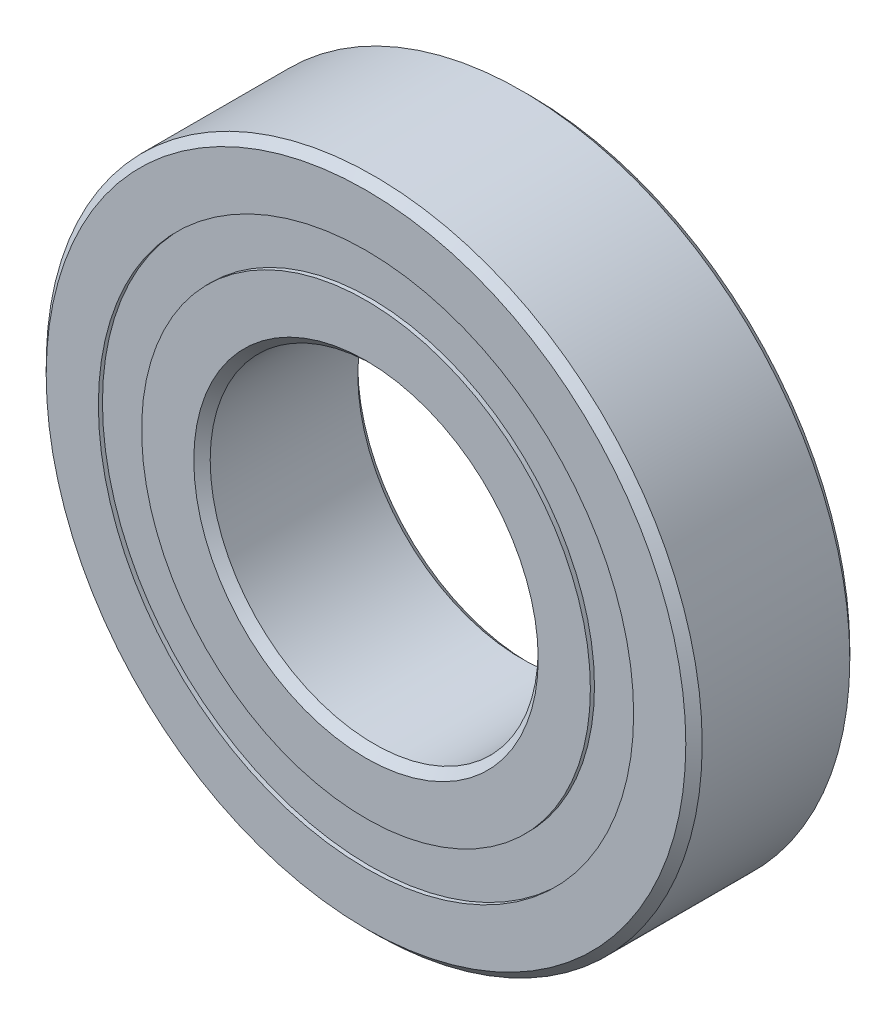
ISO-10303-21;
HEADER;
FILE_DESCRIPTION(('STEP AP214'),'2;1');
FILE_NAME('part.step','',(''),(''),'','','');
FILE_SCHEMA(('AUTOMOTIVE_DESIGN { 1 0 10303 214 1 1 1 1 }'));
ENDSEC;
DATA;
#1=APPLICATION_CONTEXT('core data for automotive mechanical design processes');
#2=APPLICATION_PROTOCOL_DEFINITION('international standard','automotive_design',2000,#1);
#3=PRODUCT_CONTEXT('',#1,'mechanical');
#4=PRODUCT('Part','Part','',(#3));
#5=PRODUCT_RELATED_PRODUCT_CATEGORY('part','',(#4));
#6=PRODUCT_DEFINITION_FORMATION('','',#4);
#7=PRODUCT_DEFINITION_CONTEXT('part definition',#1,'design');
#8=PRODUCT_DEFINITION('design','',#6,#7);
#9=PRODUCT_DEFINITION_SHAPE('','',#8);
#10=(LENGTH_UNIT() NAMED_UNIT(*) SI_UNIT(.MILLI.,.METRE.));
#11=(NAMED_UNIT(*) PLANE_ANGLE_UNIT() SI_UNIT($,.RADIAN.));
#12=(NAMED_UNIT(*) SI_UNIT($,.STERADIAN.) SOLID_ANGLE_UNIT());
#13=UNCERTAINTY_MEASURE_WITH_UNIT(LENGTH_MEASURE(1.E-05),#10,'distance_accuracy_value','');
#14=(GEOMETRIC_REPRESENTATION_CONTEXT(3) GLOBAL_UNCERTAINTY_ASSIGNED_CONTEXT((#13)) GLOBAL_UNIT_ASSIGNED_CONTEXT((#10,
#11,#12)) REPRESENTATION_CONTEXT('',''));
#15=CARTESIAN_POINT('',(0.,0.,0.));
#16=DIRECTION('',(0.,0.,1.));
#17=DIRECTION('',(1.,0.,0.));
#18=AXIS2_PLACEMENT_3D('',#15,#16,#17);
#19=CARTESIAN_POINT('',(0.,20.7247252747253,-6.0325));
#20=DIRECTION('',(0.,0.,1.));
#21=DIRECTION('',(1.,0.,0.));
#22=AXIS2_PLACEMENT_3D('',#19,#20,#21);
#23=PLANE('',#22);
#24=CARTESIAN_POINT('',(0.,0.,-6.0325));
#25=DIRECTION('',(0.,0.,1.));
#26=DIRECTION('',(1.,0.,0.));
#27=AXIS2_PLACEMENT_3D('',#24,#25,#26);
#28=CIRCLE('',#27,20.7247252747253);
#29=CARTESIAN_POINT('',(20.7247252747253,0.,-6.0325));
#30=VERTEX_POINT('',#29);
#31=EDGE_CURVE('E60',#30,#30,#28,.T.);
#32=ORIENTED_EDGE('',*,*,#31,.F.);
#33=EDGE_LOOP('',(#32));
#34=FACE_BOUND('',#33,.T.);
#35=CARTESIAN_POINT('',(0.,0.,-6.0325));
#36=DIRECTION('',(0.,0.,1.));
#37=DIRECTION('',(1.,0.,0.));
#38=AXIS2_PLACEMENT_3D('',#35,#36,#37);
#39=CIRCLE('',#38,17.3752747252747);
#40=CARTESIAN_POINT('',(17.3752747252747,0.,-6.0325));
#41=VERTEX_POINT('',#40);
#42=EDGE_CURVE('E11',#41,#41,#39,.T.);
#43=ORIENTED_EDGE('',*,*,#42,.T.);
#44=EDGE_LOOP('',(#43));
#45=FACE_BOUND('',#44,.T.);
#46=ADVANCED_FACE('F46',(#34,#45),#23,.F.);
#47=CARTESIAN_POINT('',(0.,0.,6.35));
#48=DIRECTION('',(0.,0.,1.));
#49=DIRECTION('',(1.,0.,0.));
#50=AXIS2_PLACEMENT_3D('',#47,#48,#49);
#51=CYLINDRICAL_SURFACE('',#50,17.3752747252747);
#52=ORIENTED_EDGE('',*,*,#42,.F.);
#53=EDGE_LOOP('',(#52));
#54=FACE_BOUND('',#53,.T.);
#55=CARTESIAN_POINT('',(0.,0.,-3.28171342706955));
#56=DIRECTION('',(0.,0.,1.));
#57=DIRECTION('',(1.,0.,0.));
#58=AXIS2_PLACEMENT_3D('',#55,#56,#57);
#59=CIRCLE('',#58,17.3752747252747);
#60=CARTESIAN_POINT('',(17.3752747252747,0.,-3.28171342706955));
#61=VERTEX_POINT('',#60);
#62=EDGE_CURVE('E52',#61,#61,#59,.T.);
#63=ORIENTED_EDGE('',*,*,#62,.T.);
#64=EDGE_LOOP('',(#63));
#65=FACE_BOUND('',#64,.T.);
#66=ADVANCED_FACE('F69',(#54,#65),#51,.F.);
#67=CARTESIAN_POINT('',(0.,20.7247252747253,-3.28171342706955));
#68=DIRECTION('',(0.,0.,-1.));
#69=DIRECTION('',(-1.,0.,0.));
#70=AXIS2_PLACEMENT_3D('',#67,#68,#69);
#71=PLANE('',#70);
#72=ORIENTED_EDGE('',*,*,#62,.F.);
#73=EDGE_LOOP('',(#72));
#74=FACE_BOUND('',#73,.T.);
#75=CARTESIAN_POINT('',(0.,0.,-3.28171342706955));
#76=DIRECTION('',(0.,0.,1.));
#77=DIRECTION('',(1.,0.,0.));
#78=AXIS2_PLACEMENT_3D('',#75,#76,#77);
#79=CIRCLE('',#78,20.7247252747253);
#80=CARTESIAN_POINT('',(20.7247252747253,0.,-3.28171342706955));
#81=VERTEX_POINT('',#80);
#82=EDGE_CURVE('E56',#81,#81,#79,.T.);
#83=ORIENTED_EDGE('',*,*,#82,.T.);
#84=EDGE_LOOP('',(#83));
#85=FACE_BOUND('',#84,.T.);
#86=ADVANCED_FACE('F73',(#74,#85),#71,.F.);
#87=CARTESIAN_POINT('',(0.,0.,6.35));
#88=DIRECTION('',(0.,0.,1.));
#89=DIRECTION('',(1.,0.,0.));
#90=AXIS2_PLACEMENT_3D('',#87,#88,#89);
#91=CYLINDRICAL_SURFACE('',#90,20.7247252747253);
#92=ORIENTED_EDGE('',*,*,#82,.F.);
#93=EDGE_LOOP('',(#92));
#94=FACE_BOUND('',#93,.T.);
#95=ORIENTED_EDGE('',*,*,#31,.T.);
#96=EDGE_LOOP('',(#95));
#97=FACE_BOUND('',#96,.T.);
#98=ADVANCED_FACE('F66',(#94,#97),#91,.T.);
#99=CLOSED_SHELL('',(#46,#66,#86,#98));
#100=MANIFOLD_SOLID_BREP('B2',#99);
#101=CARTESIAN_POINT('',(0.,20.7247252747253,6.0325));
#102=DIRECTION('',(0.,0.,-1.));
#103=DIRECTION('',(-1.,0.,0.));
#104=AXIS2_PLACEMENT_3D('',#101,#102,#103);
#105=PLANE('',#104);
#106=CARTESIAN_POINT('',(0.,0.,6.0325));
#107=DIRECTION('',(0.,0.,1.));
#108=DIRECTION('',(1.,0.,0.));
#109=AXIS2_PLACEMENT_3D('',#106,#107,#108);
#110=CIRCLE('',#109,17.3752747252747);
#111=CARTESIAN_POINT('',(17.3752747252747,0.,6.0325));
#112=VERTEX_POINT('',#111);
#113=EDGE_CURVE('E45',#112,#112,#110,.T.);
#114=ORIENTED_EDGE('',*,*,#113,.F.);
#115=EDGE_LOOP('',(#114));
#116=FACE_BOUND('',#115,.T.);
#117=CARTESIAN_POINT('',(0.,0.,6.0325));
#118=DIRECTION('',(0.,0.,1.));
#119=DIRECTION('',(1.,0.,0.));
#120=AXIS2_PLACEMENT_3D('',#117,#118,#119);
#121=CIRCLE('',#120,20.7247252747253);
#122=CARTESIAN_POINT('',(20.7247252747253,0.,6.0325));
#123=VERTEX_POINT('',#122);
#124=EDGE_CURVE('E128',#123,#123,#121,.T.);
#125=ORIENTED_EDGE('',*,*,#124,.T.);
#126=EDGE_LOOP('',(#125));
#127=FACE_BOUND('',#126,.T.);
#128=ADVANCED_FACE('F114',(#116,#127),#105,.F.);
#129=CARTESIAN_POINT('',(0.,0.,6.35));
#130=DIRECTION('',(0.,0.,1.));
#131=DIRECTION('',(1.,0.,0.));
#132=AXIS2_PLACEMENT_3D('',#129,#130,#131);
#133=CYLINDRICAL_SURFACE('',#132,17.3752747252747);
#134=CARTESIAN_POINT('',(0.,0.,3.28171342706955));
#135=DIRECTION('',(0.,0.,1.));
#136=DIRECTION('',(1.,0.,0.));
#137=AXIS2_PLACEMENT_3D('',#134,#135,#136);
#138=CIRCLE('',#137,17.3752747252747);
#139=CARTESIAN_POINT('',(17.3752747252747,0.,3.28171342706955));
#140=VERTEX_POINT('',#139);
#141=EDGE_CURVE('E120',#140,#140,#138,.T.);
#142=ORIENTED_EDGE('',*,*,#141,.F.);
#143=EDGE_LOOP('',(#142));
#144=FACE_BOUND('',#143,.T.);
#145=ORIENTED_EDGE('',*,*,#113,.T.);
#146=EDGE_LOOP('',(#145));
#147=FACE_BOUND('',#146,.T.);
#148=ADVANCED_FACE('F143',(#144,#147),#133,.F.);
#149=CARTESIAN_POINT('',(0.,20.7247252747253,3.28171342706955));
#150=DIRECTION('',(0.,0.,1.));
#151=DIRECTION('',(1.,0.,0.));
#152=AXIS2_PLACEMENT_3D('',#149,#150,#151);
#153=PLANE('',#152);
#154=CARTESIAN_POINT('',(0.,0.,3.28171342706955));
#155=DIRECTION('',(0.,0.,1.));
#156=DIRECTION('',(1.,0.,0.));
#157=AXIS2_PLACEMENT_3D('',#154,#155,#156);
#158=CIRCLE('',#157,20.7247252747253);
#159=CARTESIAN_POINT('',(20.7247252747253,0.,3.28171342706955));
#160=VERTEX_POINT('',#159);
#161=EDGE_CURVE('E124',#160,#160,#158,.T.);
#162=ORIENTED_EDGE('',*,*,#161,.F.);
#163=EDGE_LOOP('',(#162));
#164=FACE_BOUND('',#163,.T.);
#165=ORIENTED_EDGE('',*,*,#141,.T.);
#166=EDGE_LOOP('',(#165));
#167=FACE_BOUND('',#166,.T.);
#168=ADVANCED_FACE('F138',(#164,#167),#153,.F.);
#169=CARTESIAN_POINT('',(0.,0.,6.35));
#170=DIRECTION('',(0.,0.,1.));
#171=DIRECTION('',(1.,0.,0.));
#172=AXIS2_PLACEMENT_3D('',#169,#170,#171);
#173=CYLINDRICAL_SURFACE('',#172,20.7247252747253);
#174=ORIENTED_EDGE('',*,*,#124,.F.);
#175=EDGE_LOOP('',(#174));
#176=FACE_BOUND('',#175,.T.);
#177=ORIENTED_EDGE('',*,*,#161,.T.);
#178=EDGE_LOOP('',(#177));
#179=FACE_BOUND('',#178,.T.);
#180=ADVANCED_FACE('F135',(#176,#179),#173,.T.);
#181=CLOSED_SHELL('',(#128,#148,#168,#180));
#182=MANIFOLD_SOLID_BREP('B6',#181);
#183=CARTESIAN_POINT('',(-9.52499999999979,16.4977839420937,0.));
#184=DIRECTION('',(0.,0.,1.));
#185=DIRECTION('',(-0.499999999999989,0.866025403784445,0.));
#186=AXIS2_PLACEMENT_3D('',#183,#184,#185);
#187=SPHERICAL_SURFACE('',#186,3.28171342706955);
#188=CARTESIAN_POINT('',(-9.52499999999979,16.4977839420937,3.28171342706955));
#189=VERTEX_POINT('',#188);
#190=VERTEX_LOOP('',#189);
#191=FACE_BOUND('',#190,.T.);
#192=ADVANCED_FACE('F182',(#191),#187,.T.);
#193=CLOSED_SHELL('',(#192));
#194=MANIFOLD_SOLID_BREP('B40',#193);
#195=CARTESIAN_POINT('',(-16.4977839420934,9.52500000000019,0.));
#196=DIRECTION('',(0.,0.,1.));
#197=DIRECTION('',(-0.866025403784433,0.50000000000001,0.));
#198=AXIS2_PLACEMENT_3D('',#195,#196,#197);
#199=SPHERICAL_SURFACE('',#198,3.28171342706955);
#200=CARTESIAN_POINT('',(-16.4977839420934,9.52500000000019,3.28171342706955));
#201=VERTEX_POINT('',#200);
#202=VERTEX_LOOP('',#201);
#203=FACE_BOUND('',#202,.T.);
#204=ADVANCED_FACE('F203',(#203),#199,.T.);
#205=CLOSED_SHELL('',(#204));
#206=MANIFOLD_SOLID_BREP('B110',#205);
#207=CARTESIAN_POINT('',(-19.05,1.99538158514885E-13,0.));
#208=DIRECTION('',(0.,0.,1.));
#209=DIRECTION('',(-1.,0.,0.));
#210=AXIS2_PLACEMENT_3D('',#207,#208,#209);
#211=SPHERICAL_SURFACE('',#210,3.28171342706955);
#212=CARTESIAN_POINT('',(-19.05,1.99538158514885E-13,3.28171342706955));
#213=VERTEX_POINT('',#212);
#214=VERTEX_LOOP('',#213);
#215=FACE_BOUND('',#214,.T.);
#216=ADVANCED_FACE('F224',(#215),#211,.T.);
#217=CLOSED_SHELL('',(#216));
#218=MANIFOLD_SOLID_BREP('B178',#217);
#219=CARTESIAN_POINT('',(-16.4977839420936,-9.52499999999985,0.));
#220=DIRECTION('',(0.,0.,1.));
#221=DIRECTION('',(-0.866025403784443,-0.499999999999992,0.));
#222=AXIS2_PLACEMENT_3D('',#219,#220,#221);
#223=SPHERICAL_SURFACE('',#222,3.28171342706955);
#224=CARTESIAN_POINT('',(-16.4977839420936,-9.52499999999985,3.28171342706955));
#225=VERTEX_POINT('',#224);
#226=VERTEX_LOOP('',#225);
#227=FACE_BOUND('',#226,.T.);
#228=ADVANCED_FACE('F245',(#227),#223,.T.);
#229=CLOSED_SHELL('',(#228));
#230=MANIFOLD_SOLID_BREP('B199',#229);
#231=CARTESIAN_POINT('',(-9.52500000000013,-16.4977839420935,0.));
#232=DIRECTION('',(0.,0.,1.));
#233=DIRECTION('',(-0.500000000000007,-0.866025403784435,0.));
#234=AXIS2_PLACEMENT_3D('',#231,#232,#233);
#235=SPHERICAL_SURFACE('',#234,3.28171342706955);
#236=CARTESIAN_POINT('',(-9.52500000000013,-16.4977839420935,3.28171342706955));
#237=VERTEX_POINT('',#236);
#238=VERTEX_LOOP('',#237);
#239=FACE_BOUND('',#238,.T.);
#240=ADVANCED_FACE('F266',(#239),#235,.T.);
#241=CLOSED_SHELL('',(#240));
#242=MANIFOLD_SOLID_BREP('B220',#241);
#243=CARTESIAN_POINT('',(-1.33025439009923E-13,-19.05,0.));
#244=DIRECTION('',(0.,0.,1.));
#245=DIRECTION('',(0.,-1.,0.));
#246=AXIS2_PLACEMENT_3D('',#243,#244,#245);
#247=SPHERICAL_SURFACE('',#246,3.28171342706955);
#248=CARTESIAN_POINT('',(-1.33025439009923E-13,-19.05,3.28171342706955));
#249=VERTEX_POINT('',#248);
#250=VERTEX_LOOP('',#249);
#251=FACE_BOUND('',#250,.T.);
#252=ADVANCED_FACE('F287',(#251),#247,.T.);
#253=CLOSED_SHELL('',(#252));
#254=MANIFOLD_SOLID_BREP('B241',#253);
#255=CARTESIAN_POINT('',(9.5249999999999,-16.4977839420936,0.));
#256=DIRECTION('',(0.,0.,1.));
#257=DIRECTION('',(0.499999999999995,-0.866025403784442,0.));
#258=AXIS2_PLACEMENT_3D('',#255,#256,#257);
#259=SPHERICAL_SURFACE('',#258,3.28171342706955);
#260=CARTESIAN_POINT('',(9.5249999999999,-16.4977839420936,3.28171342706955));
#261=VERTEX_POINT('',#260);
#262=VERTEX_LOOP('',#261);
#263=FACE_BOUND('',#262,.T.);
#264=ADVANCED_FACE('F308',(#263),#259,.T.);
#265=CLOSED_SHELL('',(#264));
#266=MANIFOLD_SOLID_BREP('B262',#265);
#267=CARTESIAN_POINT('',(16.4977839420935,-9.52500000000008,0.));
#268=DIRECTION('',(0.,0.,1.));
#269=DIRECTION('',(0.866025403784436,-0.500000000000004,0.));
#270=AXIS2_PLACEMENT_3D('',#267,#268,#269);
#271=SPHERICAL_SURFACE('',#270,3.28171342706955);
#272=CARTESIAN_POINT('',(16.4977839420935,-9.52500000000008,3.28171342706955));
#273=VERTEX_POINT('',#272);
#274=VERTEX_LOOP('',#273);
#275=FACE_BOUND('',#274,.T.);
#276=ADVANCED_FACE('F329',(#275),#271,.T.);
#277=CLOSED_SHELL('',(#276));
#278=MANIFOLD_SOLID_BREP('B283',#277);
#279=CARTESIAN_POINT('',(19.05,0.,0.));
#280=DIRECTION('',(0.,0.,1.));
#281=DIRECTION('',(1.,0.,0.));
#282=AXIS2_PLACEMENT_3D('',#279,#280,#281);
#283=SPHERICAL_SURFACE('',#282,3.28171342706955);
#284=CARTESIAN_POINT('',(19.05,0.,3.28171342706955));
#285=VERTEX_POINT('',#284);
#286=VERTEX_LOOP('',#285);
#287=FACE_BOUND('',#286,.T.);
#288=ADVANCED_FACE('F350',(#287),#283,.T.);
#289=CLOSED_SHELL('',(#288));
#290=MANIFOLD_SOLID_BREP('B304',#289);
#291=CARTESIAN_POINT('',(16.4977839420936,9.52499999999996,0.));
#292=DIRECTION('',(0.,0.,1.));
#293=DIRECTION('',(0.86602540378444,0.499999999999998,0.));
#294=AXIS2_PLACEMENT_3D('',#291,#292,#293);
#295=SPHERICAL_SURFACE('',#294,3.28171342706955);
#296=CARTESIAN_POINT('',(16.4977839420936,9.52499999999996,3.28171342706955));
#297=VERTEX_POINT('',#296);
#298=VERTEX_LOOP('',#297);
#299=FACE_BOUND('',#298,.T.);
#300=ADVANCED_FACE('F371',(#299),#295,.T.);
#301=CLOSED_SHELL('',(#300));
#302=MANIFOLD_SOLID_BREP('B325',#301);
#303=CARTESIAN_POINT('',(9.52500000000002,16.4977839420935,0.));
#304=DIRECTION('',(0.,0.,1.));
#305=DIRECTION('',(0.500000000000001,0.866025403784438,0.));
#306=AXIS2_PLACEMENT_3D('',#303,#304,#305);
#307=SPHERICAL_SURFACE('',#306,3.28171342706955);
#308=CARTESIAN_POINT('',(9.52500000000002,16.4977839420935,3.28171342706955));
#309=VERTEX_POINT('',#308);
#310=VERTEX_LOOP('',#309);
#311=FACE_BOUND('',#310,.T.);
#312=ADVANCED_FACE('F392',(#311),#307,.T.);
#313=CLOSED_SHELL('',(#312));
#314=MANIFOLD_SOLID_BREP('B346',#313);
#315=CARTESIAN_POINT('',(0.,19.05,0.));
#316=DIRECTION('',(0.,0.,1.));
#317=DIRECTION('',(0.,1.,0.));
#318=AXIS2_PLACEMENT_3D('',#315,#316,#317);
#319=SPHERICAL_SURFACE('',#318,3.28171342706955);
#320=CARTESIAN_POINT('',(0.,19.05,3.28171342706955));
#321=VERTEX_POINT('',#320);
#322=VERTEX_LOOP('',#321);
#323=FACE_BOUND('',#322,.T.);
#324=ADVANCED_FACE('F415',(#323),#319,.T.);
#325=CLOSED_SHELL('',(#324));
#326=MANIFOLD_SOLID_BREP('B367',#325);
#327=CARTESIAN_POINT('',(0.,17.3752747252747,6.35));
#328=DIRECTION('',(0.,0.,-1.));
#329=DIRECTION('',(-1.,0.,0.));
#330=AXIS2_PLACEMENT_3D('',#327,#328,#329);
#331=PLANE('',#330);
#332=CARTESIAN_POINT('',(0.,0.,6.35));
#333=DIRECTION('',(0.,0.,1.));
#334=DIRECTION('',(1.,0.,0.));
#335=AXIS2_PLACEMENT_3D('',#332,#333,#334);
#336=CIRCLE('',#335,13.335);
#337=CARTESIAN_POINT('',(13.335,0.,6.35));
#338=VERTEX_POINT('',#337);
#339=EDGE_CURVE('E463',#338,#338,#336,.T.);
#340=ORIENTED_EDGE('',*,*,#339,.F.);
#341=EDGE_LOOP('',(#340));
#342=FACE_BOUND('',#341,.T.);
#343=CARTESIAN_POINT('',(0.,0.,6.35));
#344=DIRECTION('',(0.,0.,1.));
#345=DIRECTION('',(1.,0.,0.));
#346=AXIS2_PLACEMENT_3D('',#343,#344,#345);
#347=CIRCLE('',#346,17.3752747252747);
#348=CARTESIAN_POINT('',(17.3752747252747,0.,6.35));
#349=VERTEX_POINT('',#348);
#350=EDGE_CURVE('E414',#349,#349,#347,.T.);
#351=ORIENTED_EDGE('',*,*,#350,.T.);
#352=EDGE_LOOP('',(#351));
#353=FACE_BOUND('',#352,.T.);
#354=ADVANCED_FACE('F435',(#342,#353),#331,.F.);
#355=CARTESIAN_POINT('',(0.,0.,6.35));
#356=DIRECTION('',(0.,0.,1.));
#357=DIRECTION('',(1.,0.,0.));
#358=AXIS2_PLACEMENT_3D('',#355,#356,#357);
#359=CYLINDRICAL_SURFACE('',#358,17.3752747252747);
#360=ORIENTED_EDGE('',*,*,#350,.F.);
#361=EDGE_LOOP('',(#360));
#362=FACE_BOUND('',#361,.T.);
#363=CARTESIAN_POINT('',(0.,0.,2.82222222222222));
#364=DIRECTION('',(0.,0.,1.));
#365=DIRECTION('',(1.,0.,0.));
#366=AXIS2_PLACEMENT_3D('',#363,#364,#365);
#367=CIRCLE('',#366,17.3752747252747);
#368=CARTESIAN_POINT('',(17.3752747252747,0.,2.82222222222222));
#369=VERTEX_POINT('',#368);
#370=EDGE_CURVE('E441',#369,#369,#367,.T.);
#371=ORIENTED_EDGE('',*,*,#370,.T.);
#372=EDGE_LOOP('',(#371));
#373=FACE_BOUND('',#372,.T.);
#374=ADVANCED_FACE('F470',(#362,#373),#359,.T.);
#375=CARTESIAN_POINT('',(0.,0.,0.));
#376=DIRECTION('',(0.,0.,1.));
#377=DIRECTION('',(1.,0.,0.));
#378=AXIS2_PLACEMENT_3D('',#375,#376,#377);
#379=TOROIDAL_SURFACE('',#378,19.05,3.28171342706955);
#380=ORIENTED_EDGE('',*,*,#370,.F.);
#381=EDGE_LOOP('',(#380));
#382=FACE_BOUND('',#381,.T.);
#383=CARTESIAN_POINT('',(0.,0.,-2.82222222222223));
#384=DIRECTION('',(0.,0.,1.));
#385=DIRECTION('',(1.,0.,0.));
#386=AXIS2_PLACEMENT_3D('',#383,#384,#385);
#387=CIRCLE('',#386,17.3752747252747);
#388=CARTESIAN_POINT('',(17.3752747252747,0.,-2.82222222222223));
#389=VERTEX_POINT('',#388);
#390=EDGE_CURVE('E445',#389,#389,#387,.T.);
#391=ORIENTED_EDGE('',*,*,#390,.T.);
#392=EDGE_LOOP('',(#391));
#393=FACE_BOUND('',#392,.T.);
#394=ADVANCED_FACE('F474',(#382,#393),#379,.F.);
#395=CARTESIAN_POINT('',(0.,0.,6.35));
#396=DIRECTION('',(0.,0.,1.));
#397=DIRECTION('',(1.,0.,0.));
#398=AXIS2_PLACEMENT_3D('',#395,#396,#397);
#399=CYLINDRICAL_SURFACE('',#398,17.3752747252747);
#400=ORIENTED_EDGE('',*,*,#390,.F.);
#401=EDGE_LOOP('',(#400));
#402=FACE_BOUND('',#401,.T.);
#403=CARTESIAN_POINT('',(0.,0.,-6.35));
#404=DIRECTION('',(0.,0.,1.));
#405=DIRECTION('',(1.,0.,0.));
#406=AXIS2_PLACEMENT_3D('',#403,#404,#405);
#407=CIRCLE('',#406,17.3752747252747);
#408=CARTESIAN_POINT('',(17.3752747252747,0.,-6.35));
#409=VERTEX_POINT('',#408);
#410=EDGE_CURVE('E449',#409,#409,#407,.T.);
#411=ORIENTED_EDGE('',*,*,#410,.T.);
#412=EDGE_LOOP('',(#411));
#413=FACE_BOUND('',#412,.T.);
#414=ADVANCED_FACE('F479',(#402,#413),#399,.T.);
#415=CARTESIAN_POINT('',(0.,13.335,-6.35));
#416=DIRECTION('',(0.,0.,1.));
#417=DIRECTION('',(1.,0.,0.));
#418=AXIS2_PLACEMENT_3D('',#415,#416,#417);
#419=PLANE('',#418);
#420=ORIENTED_EDGE('',*,*,#410,.F.);
#421=EDGE_LOOP('',(#420));
#422=FACE_BOUND('',#421,.T.);
#423=CARTESIAN_POINT('',(0.,0.,-6.35));
#424=DIRECTION('',(0.,0.,1.));
#425=DIRECTION('',(1.,0.,0.));
#426=AXIS2_PLACEMENT_3D('',#423,#424,#425);
#427=CIRCLE('',#426,13.335);
#428=CARTESIAN_POINT('',(13.335,0.,-6.35));
#429=VERTEX_POINT('',#428);
#430=EDGE_CURVE('E454',#429,#429,#427,.T.);
#431=ORIENTED_EDGE('',*,*,#430,.T.);
#432=EDGE_LOOP('',(#431));
#433=FACE_BOUND('',#432,.T.);
#434=ADVANCED_FACE('F485',(#422,#433),#419,.F.);
#435=CARTESIAN_POINT('',(0.,0.,-5.715));
#436=DIRECTION('',(0.,0.,-1.));
#437=DIRECTION('',(-1.,0.,0.));
#438=AXIS2_PLACEMENT_3D('',#435,#436,#437);
#439=CONICAL_SURFACE('',#438,12.7,0.785398163397446);
#440=ORIENTED_EDGE('',*,*,#430,.F.);
#441=EDGE_LOOP('',(#440));
#442=FACE_BOUND('',#441,.T.);
#443=CARTESIAN_POINT('',(0.,0.,-5.715));
#444=DIRECTION('',(0.,0.,1.));
#445=DIRECTION('',(1.,0.,0.));
#446=AXIS2_PLACEMENT_3D('',#443,#444,#445);
#447=CIRCLE('',#446,12.7);
#448=CARTESIAN_POINT('',(12.7,0.,-5.715));
#449=VERTEX_POINT('',#448);
#450=EDGE_CURVE('E457',#449,#449,#447,.T.);
#451=ORIENTED_EDGE('',*,*,#450,.T.);
#452=EDGE_LOOP('',(#451));
#453=FACE_BOUND('',#452,.T.);
#454=ADVANCED_FACE('F489',(#442,#453),#439,.F.);
#455=CARTESIAN_POINT('',(0.,0.,6.35));
#456=DIRECTION('',(0.,0.,1.));
#457=DIRECTION('',(1.,0.,0.));
#458=AXIS2_PLACEMENT_3D('',#455,#456,#457);
#459=CYLINDRICAL_SURFACE('',#458,12.7);
#460=ORIENTED_EDGE('',*,*,#450,.F.);
#461=EDGE_LOOP('',(#460));
#462=FACE_BOUND('',#461,.T.);
#463=CARTESIAN_POINT('',(0.,0.,5.71500000000001));
#464=DIRECTION('',(0.,0.,1.));
#465=DIRECTION('',(1.,0.,0.));
#466=AXIS2_PLACEMENT_3D('',#463,#464,#465);
#467=CIRCLE('',#466,12.7);
#468=CARTESIAN_POINT('',(12.7,0.,5.71500000000001));
#469=VERTEX_POINT('',#468);
#470=EDGE_CURVE('E460',#469,#469,#467,.T.);
#471=ORIENTED_EDGE('',*,*,#470,.T.);
#472=EDGE_LOOP('',(#471));
#473=FACE_BOUND('',#472,.T.);
#474=ADVANCED_FACE('F493',(#462,#473),#459,.F.);
#475=CARTESIAN_POINT('',(0.,0.,6.35));
#476=DIRECTION('',(0.,0.,1.));
#477=DIRECTION('',(1.,0.,0.));
#478=AXIS2_PLACEMENT_3D('',#475,#476,#477);
#479=CONICAL_SURFACE('',#478,13.335,0.78539816339745);
#480=ORIENTED_EDGE('',*,*,#470,.F.);
#481=EDGE_LOOP('',(#480));
#482=FACE_BOUND('',#481,.T.);
#483=ORIENTED_EDGE('',*,*,#339,.T.);
#484=EDGE_LOOP('',(#483));
#485=FACE_BOUND('',#484,.T.);
#486=ADVANCED_FACE('F467',(#482,#485),#479,.F.);
#487=CLOSED_SHELL('',(#354,#374,#394,#414,#434,#454,#474,#486));
#488=MANIFOLD_SOLID_BREP('B388',#487);
#489=CARTESIAN_POINT('',(0.,0.,5.715));
#490=DIRECTION('',(0.,0.,-1.));
#491=DIRECTION('',(-1.,0.,0.));
#492=AXIS2_PLACEMENT_3D('',#489,#490,#491);
#493=CONICAL_SURFACE('',#492,25.4,0.785398163397446);
#494=CARTESIAN_POINT('',(0.,0.,6.35));
#495=DIRECTION('',(0.,0.,1.));
#496=DIRECTION('',(1.,0.,0.));
#497=AXIS2_PLACEMENT_3D('',#494,#495,#496);
#498=CIRCLE('',#497,24.765);
#499=CARTESIAN_POINT('',(24.765,0.,6.35));
#500=VERTEX_POINT('',#499);
#501=EDGE_CURVE('E585',#500,#500,#498,.T.);
#502=ORIENTED_EDGE('',*,*,#501,.F.);
#503=EDGE_LOOP('',(#502));
#504=FACE_BOUND('',#503,.T.);
#505=CARTESIAN_POINT('',(0.,0.,5.715));
#506=DIRECTION('',(0.,0.,1.));
#507=DIRECTION('',(1.,0.,0.));
#508=AXIS2_PLACEMENT_3D('',#505,#506,#507);
#509=CIRCLE('',#508,25.4);
#510=CARTESIAN_POINT('',(25.4,0.,5.715));
#511=VERTEX_POINT('',#510);
#512=EDGE_CURVE('E434',#511,#511,#509,.T.);
#513=ORIENTED_EDGE('',*,*,#512,.T.);
#514=EDGE_LOOP('',(#513));
#515=FACE_BOUND('',#514,.T.);
#516=ADVANCED_FACE('F557',(#504,#515),#493,.T.);
#517=CARTESIAN_POINT('',(0.,0.,6.35));
#518=DIRECTION('',(0.,0.,1.));
#519=DIRECTION('',(1.,0.,0.));
#520=AXIS2_PLACEMENT_3D('',#517,#518,#519);
#521=CYLINDRICAL_SURFACE('',#520,25.4);
#522=ORIENTED_EDGE('',*,*,#512,.F.);
#523=EDGE_LOOP('',(#522));
#524=FACE_BOUND('',#523,.T.);
#525=CARTESIAN_POINT('',(0.,0.,-5.715));
#526=DIRECTION('',(0.,0.,1.));
#527=DIRECTION('',(1.,0.,0.));
#528=AXIS2_PLACEMENT_3D('',#525,#526,#527);
#529=CIRCLE('',#528,25.4);
#530=CARTESIAN_POINT('',(25.4,0.,-5.715));
#531=VERTEX_POINT('',#530);
#532=EDGE_CURVE('E563',#531,#531,#529,.T.);
#533=ORIENTED_EDGE('',*,*,#532,.T.);
#534=EDGE_LOOP('',(#533));
#535=FACE_BOUND('',#534,.T.);
#536=ADVANCED_FACE('F592',(#524,#535),#521,.T.);
#537=CARTESIAN_POINT('',(0.,0.,-6.35));
#538=DIRECTION('',(0.,0.,1.));
#539=DIRECTION('',(1.,0.,0.));
#540=AXIS2_PLACEMENT_3D('',#537,#538,#539);
#541=CONICAL_SURFACE('',#540,24.765,0.785398163397446);
#542=ORIENTED_EDGE('',*,*,#532,.F.);
#543=EDGE_LOOP('',(#542));
#544=FACE_BOUND('',#543,.T.);
#545=CARTESIAN_POINT('',(0.,0.,-6.35));
#546=DIRECTION('',(0.,0.,1.));
#547=DIRECTION('',(1.,0.,0.));
#548=AXIS2_PLACEMENT_3D('',#545,#546,#547);
#549=CIRCLE('',#548,24.765);
#550=CARTESIAN_POINT('',(24.765,0.,-6.35));
#551=VERTEX_POINT('',#550);
#552=EDGE_CURVE('E567',#551,#551,#549,.T.);
#553=ORIENTED_EDGE('',*,*,#552,.T.);
#554=EDGE_LOOP('',(#553));
#555=FACE_BOUND('',#554,.T.);
#556=ADVANCED_FACE('F596',(#544,#555),#541,.T.);
#557=CARTESIAN_POINT('',(0.,24.765,-6.35));
#558=DIRECTION('',(0.,0.,1.));
#559=DIRECTION('',(1.,0.,0.));
#560=AXIS2_PLACEMENT_3D('',#557,#558,#559);
#561=PLANE('',#560);
#562=ORIENTED_EDGE('',*,*,#552,.F.);
#563=EDGE_LOOP('',(#562));
#564=FACE_BOUND('',#563,.T.);
#565=CARTESIAN_POINT('',(0.,0.,-6.35));
#566=DIRECTION('',(0.,0.,1.));
#567=DIRECTION('',(1.,0.,0.));
#568=AXIS2_PLACEMENT_3D('',#565,#566,#567);
#569=CIRCLE('',#568,20.7247252747253);
#570=CARTESIAN_POINT('',(20.7247252747253,0.,-6.35));
#571=VERTEX_POINT('',#570);
#572=EDGE_CURVE('E571',#571,#571,#569,.T.);
#573=ORIENTED_EDGE('',*,*,#572,.T.);
#574=EDGE_LOOP('',(#573));
#575=FACE_BOUND('',#574,.T.);
#576=ADVANCED_FACE('F601',(#564,#575),#561,.F.);
#577=CARTESIAN_POINT('',(0.,0.,6.35));
#578=DIRECTION('',(0.,0.,1.));
#579=DIRECTION('',(1.,0.,0.));
#580=AXIS2_PLACEMENT_3D('',#577,#578,#579);
#581=CYLINDRICAL_SURFACE('',#580,20.7247252747253);
#582=ORIENTED_EDGE('',*,*,#572,.F.);
#583=EDGE_LOOP('',(#582));
#584=FACE_BOUND('',#583,.T.);
#585=CARTESIAN_POINT('',(0.,0.,-2.82222222222222));
#586=DIRECTION('',(0.,0.,1.));
#587=DIRECTION('',(1.,0.,0.));
#588=AXIS2_PLACEMENT_3D('',#585,#586,#587);
#589=CIRCLE('',#588,20.7247252747253);
#590=CARTESIAN_POINT('',(20.7247252747253,0.,-2.82222222222222));
#591=VERTEX_POINT('',#590);
#592=EDGE_CURVE('E576',#591,#591,#589,.T.);
#593=ORIENTED_EDGE('',*,*,#592,.T.);
#594=EDGE_LOOP('',(#593));
#595=FACE_BOUND('',#594,.T.);
#596=ADVANCED_FACE('F607',(#584,#595),#581,.F.);
#597=CARTESIAN_POINT('',(0.,0.,0.));
#598=DIRECTION('',(0.,0.,1.));
#599=DIRECTION('',(1.,0.,0.));
#600=AXIS2_PLACEMENT_3D('',#597,#598,#599);
#601=TOROIDAL_SURFACE('',#600,19.05,3.28171342706955);
#602=ORIENTED_EDGE('',*,*,#592,.F.);
#603=EDGE_LOOP('',(#602));
#604=FACE_BOUND('',#603,.T.);
#605=CARTESIAN_POINT('',(0.,0.,2.82222222222222));
#606=DIRECTION('',(0.,0.,1.));
#607=DIRECTION('',(1.,0.,0.));
#608=AXIS2_PLACEMENT_3D('',#605,#606,#607);
#609=CIRCLE('',#608,20.7247252747253);
#610=CARTESIAN_POINT('',(20.7247252747253,0.,2.82222222222222));
#611=VERTEX_POINT('',#610);
#612=EDGE_CURVE('E579',#611,#611,#609,.T.);
#613=ORIENTED_EDGE('',*,*,#612,.T.);
#614=EDGE_LOOP('',(#613));
#615=FACE_BOUND('',#614,.T.);
#616=ADVANCED_FACE('F611',(#604,#615),#601,.F.);
#617=CARTESIAN_POINT('',(0.,0.,6.35));
#618=DIRECTION('',(0.,0.,1.));
#619=DIRECTION('',(1.,0.,0.));
#620=AXIS2_PLACEMENT_3D('',#617,#618,#619);
#621=CYLINDRICAL_SURFACE('',#620,20.7247252747253);
#622=ORIENTED_EDGE('',*,*,#612,.F.);
#623=EDGE_LOOP('',(#622));
#624=FACE_BOUND('',#623,.T.);
#625=CARTESIAN_POINT('',(0.,0.,6.35));
#626=DIRECTION('',(0.,0.,1.));
#627=DIRECTION('',(1.,0.,0.));
#628=AXIS2_PLACEMENT_3D('',#625,#626,#627);
#629=CIRCLE('',#628,20.7247252747253);
#630=CARTESIAN_POINT('',(20.7247252747253,0.,6.35));
#631=VERTEX_POINT('',#630);
#632=EDGE_CURVE('E582',#631,#631,#629,.T.);
#633=ORIENTED_EDGE('',*,*,#632,.T.);
#634=EDGE_LOOP('',(#633));
#635=FACE_BOUND('',#634,.T.);
#636=ADVANCED_FACE('F615',(#624,#635),#621,.F.);
#637=CARTESIAN_POINT('',(0.,24.765,6.35));
#638=DIRECTION('',(0.,0.,-1.));
#639=DIRECTION('',(-1.,0.,0.));
#640=AXIS2_PLACEMENT_3D('',#637,#638,#639);
#641=PLANE('',#640);
#642=ORIENTED_EDGE('',*,*,#632,.F.);
#643=EDGE_LOOP('',(#642));
#644=FACE_BOUND('',#643,.T.);
#645=ORIENTED_EDGE('',*,*,#501,.T.);
#646=EDGE_LOOP('',(#645));
#647=FACE_BOUND('',#646,.T.);
#648=ADVANCED_FACE('F589',(#644,#647),#641,.F.);
#649=CLOSED_SHELL('',(#516,#536,#556,#576,#596,#616,#636,#648));
#650=MANIFOLD_SOLID_BREP('B409',#649);
#651=ADVANCED_BREP_SHAPE_REPRESENTATION('',(#18,#100,#182,#194,#206,#218,#230,#242,#254,#266,
#278,#290,#302,#314,#326,#488,#650),#14);
#652=SHAPE_DEFINITION_REPRESENTATION(#9,#651);
ENDSEC;
END-ISO-10303-21;
